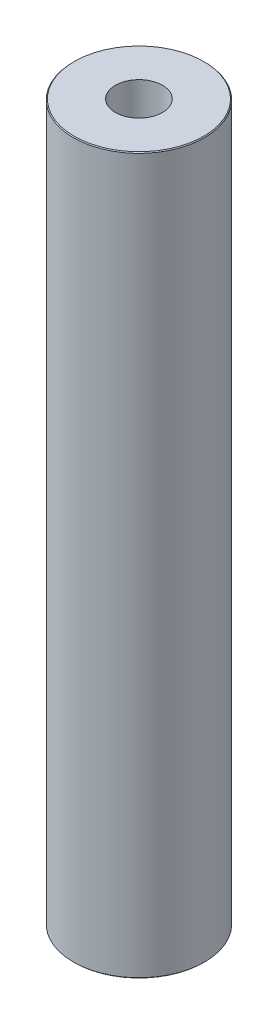
ISO-10303-21;
HEADER;
FILE_DESCRIPTION(('STEP AP214'),'2;1');
FILE_NAME('part.step','',(''),(''),'','','');
FILE_SCHEMA(('AUTOMOTIVE_DESIGN { 1 0 10303 214 1 1 1 1 }'));
ENDSEC;
DATA;
#1=APPLICATION_CONTEXT('core data for automotive mechanical design processes');
#2=APPLICATION_PROTOCOL_DEFINITION('international standard','automotive_design',2000,#1);
#3=PRODUCT_CONTEXT('',#1,'mechanical');
#4=PRODUCT('Part','Part','',(#3));
#5=PRODUCT_RELATED_PRODUCT_CATEGORY('part','',(#4));
#6=PRODUCT_DEFINITION_FORMATION('','',#4);
#7=PRODUCT_DEFINITION_CONTEXT('part definition',#1,'design');
#8=PRODUCT_DEFINITION('design','',#6,#7);
#9=PRODUCT_DEFINITION_SHAPE('','',#8);
#10=(LENGTH_UNIT() NAMED_UNIT(*) SI_UNIT(.MILLI.,.METRE.));
#11=(NAMED_UNIT(*) PLANE_ANGLE_UNIT() SI_UNIT($,.RADIAN.));
#12=(NAMED_UNIT(*) SI_UNIT($,.STERADIAN.) SOLID_ANGLE_UNIT());
#13=UNCERTAINTY_MEASURE_WITH_UNIT(LENGTH_MEASURE(1.E-05),#10,'distance_accuracy_value','');
#14=(GEOMETRIC_REPRESENTATION_CONTEXT(3) GLOBAL_UNCERTAINTY_ASSIGNED_CONTEXT((#13)) GLOBAL_UNIT_ASSIGNED_CONTEXT((#10,
#11,#12)) REPRESENTATION_CONTEXT('',''));
#15=CARTESIAN_POINT('',(0.,0.,0.));
#16=DIRECTION('',(0.,0.,1.));
#17=DIRECTION('',(1.,0.,0.));
#18=AXIS2_PLACEMENT_3D('',#15,#16,#17);
#19=CARTESIAN_POINT('',(0.,600.,0.));
#20=DIRECTION('',(0.,-1.,0.));
#21=DIRECTION('',(0.,0.,-1.));
#22=AXIS2_PLACEMENT_3D('',#19,#20,#21);
#23=CYLINDRICAL_SURFACE('',#22,55.);
#24=CARTESIAN_POINT('',(0.,599.298959030454,0.));
#25=DIRECTION('',(0.,1.,0.));
#26=DIRECTION('',(0.,0.,1.));
#27=AXIS2_PLACEMENT_3D('',#24,#25,#26);
#28=CIRCLE('',#27,55.);
#29=CARTESIAN_POINT('',(0.,599.298959030454,55.));
#30=VERTEX_POINT('',#29);
#31=EDGE_CURVE('E50',#30,#30,#28,.F.);
#32=ORIENTED_EDGE('',*,*,#31,.T.);
#33=EDGE_LOOP('',(#32));
#34=FACE_BOUND('',#33,.T.);
#35=CARTESIAN_POINT('',(0.,0.701040969545819,0.));
#36=DIRECTION('',(0.,1.,0.));
#37=DIRECTION('',(0.,0.,1.));
#38=AXIS2_PLACEMENT_3D('',#35,#36,#37);
#39=CIRCLE('',#38,55.);
#40=CARTESIAN_POINT('',(0.,0.701040969545819,55.));
#41=VERTEX_POINT('',#40);
#42=EDGE_CURVE('E51',#41,#41,#39,.T.);
#43=ORIENTED_EDGE('',*,*,#42,.T.);
#44=EDGE_LOOP('',(#43));
#45=FACE_BOUND('',#44,.T.);
#46=ADVANCED_FACE('F39',(#34,#45),#23,.T.);
#47=CARTESIAN_POINT('',(0.,600.,0.));
#48=DIRECTION('',(0.,1.,0.));
#49=DIRECTION('',(0.,0.,1.));
#50=AXIS2_PLACEMENT_3D('',#47,#48,#49);
#51=PLANE('',#50);
#52=CARTESIAN_POINT('',(0.,600.,0.));
#53=DIRECTION('',(0.,1.,0.));
#54=DIRECTION('',(0.,0.,1.));
#55=AXIS2_PLACEMENT_3D('',#52,#53,#54);
#56=CIRCLE('',#55,54.2989590304542);
#57=CARTESIAN_POINT('',(0.,600.,54.2989590304542));
#58=VERTEX_POINT('',#57);
#59=EDGE_CURVE('E54',#58,#58,#56,.T.);
#60=ORIENTED_EDGE('',*,*,#59,.T.);
#61=EDGE_LOOP('',(#60));
#62=FACE_BOUND('',#61,.T.);
#63=CARTESIAN_POINT('',(0.,600.,0.));
#64=DIRECTION('',(0.,1.,0.));
#65=DIRECTION('',(0.,0.,1.));
#66=AXIS2_PLACEMENT_3D('',#63,#64,#65);
#67=CIRCLE('',#66,19.7729261734842);
#68=CARTESIAN_POINT('',(0.,600.,19.7729261734842));
#69=VERTEX_POINT('',#68);
#70=EDGE_CURVE('E58',#69,#69,#67,.T.);
#71=ORIENTED_EDGE('',*,*,#70,.F.);
#72=EDGE_LOOP('',(#71));
#73=FACE_BOUND('',#72,.T.);
#74=ADVANCED_FACE('F69',(#62,#73),#51,.T.);
#75=CARTESIAN_POINT('',(0.,0.,0.));
#76=DIRECTION('',(0.,1.,0.));
#77=DIRECTION('',(0.,0.,1.));
#78=AXIS2_PLACEMENT_3D('',#75,#76,#77);
#79=PLANE('',#78);
#80=CARTESIAN_POINT('',(0.,0.,0.));
#81=DIRECTION('',(0.,1.,0.));
#82=DIRECTION('',(0.,0.,1.));
#83=AXIS2_PLACEMENT_3D('',#80,#81,#82);
#84=CIRCLE('',#83,54.2989590304542);
#85=CARTESIAN_POINT('',(0.,0.,54.2989590304542));
#86=VERTEX_POINT('',#85);
#87=EDGE_CURVE('E10',#86,#86,#84,.F.);
#88=ORIENTED_EDGE('',*,*,#87,.T.);
#89=EDGE_LOOP('',(#88));
#90=FACE_BOUND('',#89,.T.);
#91=CARTESIAN_POINT('',(0.,0.,0.));
#92=DIRECTION('',(0.,1.,0.));
#93=DIRECTION('',(0.,0.,1.));
#94=AXIS2_PLACEMENT_3D('',#91,#92,#93);
#95=CIRCLE('',#94,19.7729261734842);
#96=CARTESIAN_POINT('',(0.,0.,19.7729261734842));
#97=VERTEX_POINT('',#96);
#98=EDGE_CURVE('E63',#97,#97,#95,.T.);
#99=ORIENTED_EDGE('',*,*,#98,.T.);
#100=EDGE_LOOP('',(#99));
#101=FACE_BOUND('',#100,.T.);
#102=ADVANCED_FACE('F75',(#90,#101),#79,.F.);
#103=CARTESIAN_POINT('',(0.,600.,0.));
#104=DIRECTION('',(0.,-1.,0.));
#105=DIRECTION('',(0.,0.,-1.));
#106=AXIS2_PLACEMENT_3D('',#103,#104,#105);
#107=CYLINDRICAL_SURFACE('',#106,19.7729261734842);
#108=ORIENTED_EDGE('',*,*,#70,.T.);
#109=EDGE_LOOP('',(#108));
#110=FACE_BOUND('',#109,.T.);
#111=ORIENTED_EDGE('',*,*,#98,.F.);
#112=EDGE_LOOP('',(#111));
#113=FACE_BOUND('',#112,.T.);
#114=ADVANCED_FACE('F70',(#110,#113),#107,.F.);
#115=CARTESIAN_POINT('',(0.,600.,0.));
#116=DIRECTION('',(0.,-1.,0.));
#117=DIRECTION('',(0.,0.,-1.));
#118=AXIS2_PLACEMENT_3D('',#115,#116,#117);
#119=CONICAL_SURFACE('',#118,54.2989590304542,0.785398163397458);
#120=ORIENTED_EDGE('',*,*,#31,.F.);
#121=EDGE_LOOP('',(#120));
#122=FACE_BOUND('',#121,.T.);
#123=ORIENTED_EDGE('',*,*,#59,.F.);
#124=EDGE_LOOP('',(#123));
#125=FACE_BOUND('',#124,.T.);
#126=ADVANCED_FACE('F81',(#122,#125),#119,.T.);
#127=CARTESIAN_POINT('',(0.,0.701040969545819,0.));
#128=DIRECTION('',(0.,1.,0.));
#129=DIRECTION('',(0.,0.,1.));
#130=AXIS2_PLACEMENT_3D('',#127,#128,#129);
#131=CONICAL_SURFACE('',#130,55.,0.785398163397453);
#132=ORIENTED_EDGE('',*,*,#87,.F.);
#133=EDGE_LOOP('',(#132));
#134=FACE_BOUND('',#133,.T.);
#135=ORIENTED_EDGE('',*,*,#42,.F.);
#136=EDGE_LOOP('',(#135));
#137=FACE_BOUND('',#136,.T.);
#138=ADVANCED_FACE('F45',(#134,#137),#131,.T.);
#139=CLOSED_SHELL('',(#46,#74,#102,#114,#126,#138));
#140=MANIFOLD_SOLID_BREP('B2',#139);
#141=ADVANCED_BREP_SHAPE_REPRESENTATION('',(#18,#140),#14);
#142=SHAPE_DEFINITION_REPRESENTATION(#9,#141);
ENDSEC;
END-ISO-10303-21;
